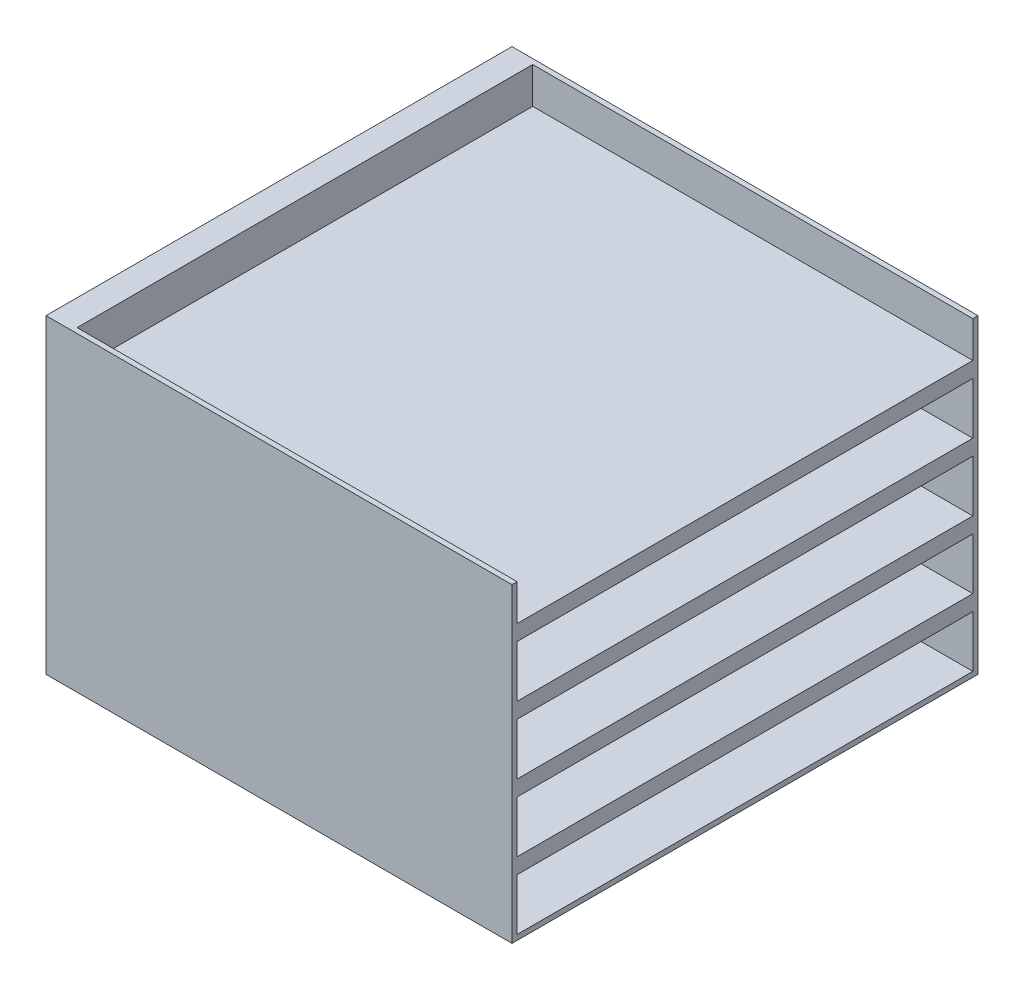
ISO-10303-21;
HEADER;
FILE_DESCRIPTION(('STEP AP214'),'2;1');
FILE_NAME('part.step','',(''),(''),'','','');
FILE_SCHEMA(('AUTOMOTIVE_DESIGN { 1 0 10303 214 1 1 1 1 }'));
ENDSEC;
DATA;
#1=APPLICATION_CONTEXT('core data for automotive mechanical design processes');
#2=APPLICATION_PROTOCOL_DEFINITION('international standard','automotive_design',2000,#1);
#3=PRODUCT_CONTEXT('',#1,'mechanical');
#4=PRODUCT('Part','Part','',(#3));
#5=PRODUCT_RELATED_PRODUCT_CATEGORY('part','',(#4));
#6=PRODUCT_DEFINITION_FORMATION('','',#4);
#7=PRODUCT_DEFINITION_CONTEXT('part definition',#1,'design');
#8=PRODUCT_DEFINITION('design','',#6,#7);
#9=PRODUCT_DEFINITION_SHAPE('','',#8);
#10=(LENGTH_UNIT() NAMED_UNIT(*) SI_UNIT(.MILLI.,.METRE.));
#11=(NAMED_UNIT(*) PLANE_ANGLE_UNIT() SI_UNIT($,.RADIAN.));
#12=(NAMED_UNIT(*) SI_UNIT($,.STERADIAN.) SOLID_ANGLE_UNIT());
#13=UNCERTAINTY_MEASURE_WITH_UNIT(LENGTH_MEASURE(1.E-05),#10,'distance_accuracy_value','');
#14=(GEOMETRIC_REPRESENTATION_CONTEXT(3) GLOBAL_UNCERTAINTY_ASSIGNED_CONTEXT((#13)) GLOBAL_UNIT_ASSIGNED_CONTEXT((#10,
#11,#12)) REPRESENTATION_CONTEXT('',''));
#15=CARTESIAN_POINT('',(0.,0.,0.));
#16=DIRECTION('',(0.,0.,1.));
#17=DIRECTION('',(1.,0.,0.));
#18=AXIS2_PLACEMENT_3D('',#15,#16,#17);
#19=CARTESIAN_POINT('',(450.,600.,-450.));
#20=DIRECTION('',(-1.,0.,0.));
#21=DIRECTION('',(0.,0.,1.));
#22=AXIS2_PLACEMENT_3D('',#19,#20,#21);
#23=PLANE('',#22);
#24=DIRECTION('',(0.,0.,-1.));
#25=VECTOR('',#24,1.);
#26=CARTESIAN_POINT('',(450.,140.,-440.));
#27=LINE('',#26,#25);
#28=CARTESIAN_POINT('',(450.,140.,440.));
#29=VERTEX_POINT('',#28);
#30=CARTESIAN_POINT('',(450.,140.,-440.));
#31=VERTEX_POINT('',#30);
#32=EDGE_CURVE('E223',#29,#31,#27,.T.);
#33=ORIENTED_EDGE('',*,*,#32,.F.);
#34=DIRECTION('',(0.,-1.,0.));
#35=VECTOR('',#34,1.);
#36=CARTESIAN_POINT('',(450.,240.,440.));
#37=LINE('',#36,#35);
#38=CARTESIAN_POINT('',(450.,240.,440.));
#39=VERTEX_POINT('',#38);
#40=EDGE_CURVE('E49',#39,#29,#37,.T.);
#41=ORIENTED_EDGE('',*,*,#40,.F.);
#42=DIRECTION('',(0.,0.,1.));
#43=VECTOR('',#42,1.);
#44=CARTESIAN_POINT('',(450.,240.,-440.));
#45=LINE('',#44,#43);
#46=CARTESIAN_POINT('',(450.,240.,-440.));
#47=VERTEX_POINT('',#46);
#48=EDGE_CURVE('E214',#47,#39,#45,.T.);
#49=ORIENTED_EDGE('',*,*,#48,.F.);
#50=DIRECTION('',(0.,1.,0.));
#51=VECTOR('',#50,1.);
#52=CARTESIAN_POINT('',(450.,240.,-440.));
#53=LINE('',#52,#51);
#54=EDGE_CURVE('E217',#31,#47,#53,.T.);
#55=ORIENTED_EDGE('',*,*,#54,.F.);
#56=EDGE_LOOP('',(#33,#41,#49,#55));
#57=FACE_BOUND('',#56,.T.);
#58=DIRECTION('',(0.,0.,-1.));
#59=VECTOR('',#58,1.);
#60=CARTESIAN_POINT('',(450.,270.,-439.999999999999));
#61=LINE('',#60,#59);
#62=CARTESIAN_POINT('',(450.,270.,440.000000000001));
#63=VERTEX_POINT('',#62);
#64=CARTESIAN_POINT('',(450.,270.,-439.999999999999));
#65=VERTEX_POINT('',#64);
#66=EDGE_CURVE('E249',#63,#65,#61,.T.);
#67=ORIENTED_EDGE('',*,*,#66,.F.);
#68=DIRECTION('',(0.,-1.,0.));
#69=VECTOR('',#68,1.);
#70=CARTESIAN_POINT('',(450.,370.,440.000000000001));
#71=LINE('',#70,#69);
#72=CARTESIAN_POINT('',(450.,370.,440.000000000001));
#73=VERTEX_POINT('',#72);
#74=EDGE_CURVE('E57',#73,#63,#71,.T.);
#75=ORIENTED_EDGE('',*,*,#74,.F.);
#76=DIRECTION('',(0.,0.,1.));
#77=VECTOR('',#76,1.);
#78=CARTESIAN_POINT('',(450.,370.,-439.999999999999));
#79=LINE('',#78,#77);
#80=CARTESIAN_POINT('',(450.,370.,-439.999999999999));
#81=VERTEX_POINT('',#80);
#82=EDGE_CURVE('E238',#81,#73,#79,.T.);
#83=ORIENTED_EDGE('',*,*,#82,.F.);
#84=DIRECTION('',(0.,1.,0.));
#85=VECTOR('',#84,1.);
#86=CARTESIAN_POINT('',(450.,370.,-439.999999999999));
#87=LINE('',#86,#85);
#88=EDGE_CURVE('E253',#65,#81,#87,.T.);
#89=ORIENTED_EDGE('',*,*,#88,.F.);
#90=EDGE_LOOP('',(#67,#75,#83,#89));
#91=FACE_BOUND('',#90,.T.);
#92=DIRECTION('',(0.,0.,-1.));
#93=VECTOR('',#92,1.);
#94=CARTESIAN_POINT('',(450.,400.,-439.999999999999));
#95=LINE('',#94,#93);
#96=CARTESIAN_POINT('',(450.,400.,440.000000000001));
#97=VERTEX_POINT('',#96);
#98=CARTESIAN_POINT('',(450.,400.,-439.999999999999));
#99=VERTEX_POINT('',#98);
#100=EDGE_CURVE('E280',#97,#99,#95,.T.);
#101=ORIENTED_EDGE('',*,*,#100,.F.);
#102=DIRECTION('',(0.,-1.,0.));
#103=VECTOR('',#102,1.);
#104=CARTESIAN_POINT('',(450.,500.,440.000000000001));
#105=LINE('',#104,#103);
#106=CARTESIAN_POINT('',(450.,500.,440.000000000001));
#107=VERTEX_POINT('',#106);
#108=EDGE_CURVE('E278',#107,#97,#105,.T.);
#109=ORIENTED_EDGE('',*,*,#108,.F.);
#110=DIRECTION('',(0.,0.,1.));
#111=VECTOR('',#110,1.);
#112=CARTESIAN_POINT('',(450.,500.,-439.999999999999));
#113=LINE('',#112,#111);
#114=CARTESIAN_POINT('',(450.,500.,-439.999999999999));
#115=VERTEX_POINT('',#114);
#116=EDGE_CURVE('E268',#115,#107,#113,.T.);
#117=ORIENTED_EDGE('',*,*,#116,.F.);
#118=DIRECTION('',(0.,1.,0.));
#119=VECTOR('',#118,1.);
#120=CARTESIAN_POINT('',(450.,500.,-439.999999999999));
#121=LINE('',#120,#119);
#122=EDGE_CURVE('E284',#99,#115,#121,.T.);
#123=ORIENTED_EDGE('',*,*,#122,.F.);
#124=EDGE_LOOP('',(#101,#109,#117,#123));
#125=FACE_BOUND('',#124,.T.);
#126=DIRECTION('',(0.,0.,-1.));
#127=VECTOR('',#126,1.);
#128=CARTESIAN_POINT('',(450.,10.,-440.));
#129=LINE('',#128,#127);
#130=CARTESIAN_POINT('',(450.,10.,440.));
#131=VERTEX_POINT('',#130);
#132=CARTESIAN_POINT('',(450.,10.,-440.));
#133=VERTEX_POINT('',#132);
#134=EDGE_CURVE('E329',#131,#133,#129,.T.);
#135=ORIENTED_EDGE('',*,*,#134,.F.);
#136=DIRECTION('',(0.,-1.,0.));
#137=VECTOR('',#136,1.);
#138=CARTESIAN_POINT('',(450.,110.,440.));
#139=LINE('',#138,#137);
#140=CARTESIAN_POINT('',(450.,110.,440.));
#141=VERTEX_POINT('',#140);
#142=EDGE_CURVE('E230',#141,#131,#139,.T.);
#143=ORIENTED_EDGE('',*,*,#142,.F.);
#144=DIRECTION('',(0.,0.,1.));
#145=VECTOR('',#144,1.);
#146=CARTESIAN_POINT('',(450.,110.,-440.));
#147=LINE('',#146,#145);
#148=CARTESIAN_POINT('',(450.,110.,-440.));
#149=VERTEX_POINT('',#148);
#150=EDGE_CURVE('E318',#149,#141,#147,.T.);
#151=ORIENTED_EDGE('',*,*,#150,.F.);
#152=DIRECTION('',(0.,1.,0.));
#153=VECTOR('',#152,1.);
#154=CARTESIAN_POINT('',(450.,110.,-440.));
#155=LINE('',#154,#153);
#156=EDGE_CURVE('E332',#133,#149,#155,.T.);
#157=ORIENTED_EDGE('',*,*,#156,.F.);
#158=EDGE_LOOP('',(#135,#143,#151,#157));
#159=FACE_BOUND('',#158,.T.);
#160=DIRECTION('',(0.,0.,-1.));
#161=VECTOR('',#160,1.);
#162=CARTESIAN_POINT('',(450.,530.,-439.999999999998));
#163=LINE('',#162,#161);
#164=CARTESIAN_POINT('',(450.,530.,440.000000000002));
#165=VERTEX_POINT('',#164);
#166=CARTESIAN_POINT('',(450.,530.,-439.999999999998));
#167=VERTEX_POINT('',#166);
#168=EDGE_CURVE('E307',#165,#167,#163,.T.);
#169=ORIENTED_EDGE('',*,*,#168,.F.);
#170=DIRECTION('',(0.,-1.,0.));
#171=VECTOR('',#170,1.);
#172=CARTESIAN_POINT('',(450.,630.,440.000000000002));
#173=LINE('',#172,#171);
#174=CARTESIAN_POINT('',(450.,600.,440.000000000002));
#175=VERTEX_POINT('',#174);
#176=EDGE_CURVE('E305',#175,#165,#173,.T.);
#177=ORIENTED_EDGE('',*,*,#176,.F.);
#178=DIRECTION('',(0.,0.,-1.));
#179=VECTOR('',#178,1.);
#180=CARTESIAN_POINT('',(450.,600.,-450.));
#181=LINE('',#180,#179);
#182=CARTESIAN_POINT('',(450.,600.,450.));
#183=VERTEX_POINT('',#182);
#184=EDGE_CURVE('E346',#183,#175,#181,.T.);
#185=ORIENTED_EDGE('',*,*,#184,.F.);
#186=DIRECTION('',(0.,-1.,0.));
#187=VECTOR('',#186,1.);
#188=CARTESIAN_POINT('',(450.,600.,450.));
#189=LINE('',#188,#187);
#190=CARTESIAN_POINT('',(450.,0.,450.));
#191=VERTEX_POINT('',#190);
#192=EDGE_CURVE('E356',#183,#191,#189,.T.);
#193=ORIENTED_EDGE('',*,*,#192,.T.);
#194=DIRECTION('',(0.,0.,-1.));
#195=VECTOR('',#194,1.);
#196=CARTESIAN_POINT('',(450.,0.,-450.));
#197=LINE('',#196,#195);
#198=CARTESIAN_POINT('',(450.,0.,-450.));
#199=VERTEX_POINT('',#198);
#200=EDGE_CURVE('E339',#191,#199,#197,.T.);
#201=ORIENTED_EDGE('',*,*,#200,.T.);
#202=DIRECTION('',(0.,-1.,0.));
#203=VECTOR('',#202,1.);
#204=CARTESIAN_POINT('',(450.,600.,-450.));
#205=LINE('',#204,#203);
#206=CARTESIAN_POINT('',(450.,600.,-450.));
#207=VERTEX_POINT('',#206);
#208=EDGE_CURVE('E373',#207,#199,#205,.T.);
#209=ORIENTED_EDGE('',*,*,#208,.F.);
#210=CARTESIAN_POINT('',(450.,600.,-439.999999999998));
#211=VERTEX_POINT('',#210);
#212=EDGE_CURVE('E350',#211,#207,#181,.T.);
#213=ORIENTED_EDGE('',*,*,#212,.F.);
#214=DIRECTION('',(0.,1.,0.));
#215=VECTOR('',#214,1.);
#216=CARTESIAN_POINT('',(450.,630.,-439.999999999998));
#217=LINE('',#216,#215);
#218=EDGE_CURVE('E299',#167,#211,#217,.T.);
#219=ORIENTED_EDGE('',*,*,#218,.F.);
#220=EDGE_LOOP('',(#169,#177,#185,#193,#201,#209,#213,#219));
#221=FACE_BOUND('',#220,.T.);
#222=ADVANCED_FACE('F35',(#57,#91,#125,#159,#221),#23,.F.);
#223=CARTESIAN_POINT('',(-450.,600.,-450.));
#224=DIRECTION('',(0.,0.,1.));
#225=DIRECTION('',(1.,0.,0.));
#226=AXIS2_PLACEMENT_3D('',#223,#224,#225);
#227=PLANE('',#226);
#228=DIRECTION('',(-1.,0.,0.));
#229=VECTOR('',#228,1.);
#230=CARTESIAN_POINT('',(-450.,0.,-450.));
#231=LINE('',#230,#229);
#232=CARTESIAN_POINT('',(-450.,0.,-450.));
#233=VERTEX_POINT('',#232);
#234=EDGE_CURVE('E359',#199,#233,#231,.T.);
#235=ORIENTED_EDGE('',*,*,#234,.T.);
#236=DIRECTION('',(0.,-1.,0.));
#237=VECTOR('',#236,1.);
#238=CARTESIAN_POINT('',(-450.,600.,-450.));
#239=LINE('',#238,#237);
#240=CARTESIAN_POINT('',(-450.,600.,-450.));
#241=VERTEX_POINT('',#240);
#242=EDGE_CURVE('E370',#241,#233,#239,.T.);
#243=ORIENTED_EDGE('',*,*,#242,.F.);
#244=DIRECTION('',(-1.,0.,0.));
#245=VECTOR('',#244,1.);
#246=CARTESIAN_POINT('',(-450.,600.,-450.));
#247=LINE('',#246,#245);
#248=EDGE_CURVE('E349',#207,#241,#247,.T.);
#249=ORIENTED_EDGE('',*,*,#248,.F.);
#250=ORIENTED_EDGE('',*,*,#208,.T.);
#251=EDGE_LOOP('',(#235,#243,#249,#250));
#252=FACE_BOUND('',#251,.T.);
#253=ADVANCED_FACE('F404',(#252),#227,.F.);
#254=CARTESIAN_POINT('',(-450.,600.,-450.));
#255=DIRECTION('',(1.,0.,0.));
#256=DIRECTION('',(0.,0.,-1.));
#257=AXIS2_PLACEMENT_3D('',#254,#255,#256);
#258=PLANE('',#257);
#259=DIRECTION('',(0.,0.,1.));
#260=VECTOR('',#259,1.);
#261=CARTESIAN_POINT('',(-450.,0.,-450.));
#262=LINE('',#261,#260);
#263=CARTESIAN_POINT('',(-450.,0.,450.));
#264=VERTEX_POINT('',#263);
#265=EDGE_CURVE('E361',#233,#264,#262,.T.);
#266=ORIENTED_EDGE('',*,*,#265,.T.);
#267=DIRECTION('',(0.,-1.,0.));
#268=VECTOR('',#267,1.);
#269=CARTESIAN_POINT('',(-450.,600.,450.));
#270=LINE('',#269,#268);
#271=CARTESIAN_POINT('',(-450.,600.,450.));
#272=VERTEX_POINT('',#271);
#273=EDGE_CURVE('E367',#272,#264,#270,.T.);
#274=ORIENTED_EDGE('',*,*,#273,.F.);
#275=DIRECTION('',(0.,0.,1.));
#276=VECTOR('',#275,1.);
#277=CARTESIAN_POINT('',(-450.,600.,-450.));
#278=LINE('',#277,#276);
#279=EDGE_CURVE('E352',#241,#272,#278,.T.);
#280=ORIENTED_EDGE('',*,*,#279,.F.);
#281=ORIENTED_EDGE('',*,*,#242,.T.);
#282=EDGE_LOOP('',(#266,#274,#280,#281));
#283=FACE_BOUND('',#282,.T.);
#284=ADVANCED_FACE('F409',(#283),#258,.F.);
#285=CARTESIAN_POINT('',(-450.,600.,450.));
#286=DIRECTION('',(0.,0.,-1.));
#287=DIRECTION('',(-1.,0.,0.));
#288=AXIS2_PLACEMENT_3D('',#285,#286,#287);
#289=PLANE('',#288);
#290=DIRECTION('',(1.,0.,0.));
#291=VECTOR('',#290,1.);
#292=CARTESIAN_POINT('',(-450.,0.,450.));
#293=LINE('',#292,#291);
#294=EDGE_CURVE('E363',#264,#191,#293,.T.);
#295=ORIENTED_EDGE('',*,*,#294,.T.);
#296=ORIENTED_EDGE('',*,*,#192,.F.);
#297=DIRECTION('',(1.,0.,0.));
#298=VECTOR('',#297,1.);
#299=CARTESIAN_POINT('',(-450.,600.,450.));
#300=LINE('',#299,#298);
#301=EDGE_CURVE('E354',#272,#183,#300,.T.);
#302=ORIENTED_EDGE('',*,*,#301,.F.);
#303=ORIENTED_EDGE('',*,*,#273,.T.);
#304=EDGE_LOOP('',(#295,#296,#302,#303));
#305=FACE_BOUND('',#304,.T.);
#306=ADVANCED_FACE('F414',(#305),#289,.F.);
#307=CARTESIAN_POINT('',(0.,600.,0.));
#308=DIRECTION('',(0.,1.,0.));
#309=DIRECTION('',(0.,0.,1.));
#310=AXIS2_PLACEMENT_3D('',#307,#308,#309);
#311=PLANE('',#310);
#312=DIRECTION('',(1.,0.,0.));
#313=VECTOR('',#312,1.);
#314=CARTESIAN_POINT('',(0.,600.,440.000000000002));
#315=LINE('',#314,#313);
#316=CARTESIAN_POINT('',(-400.,600.,440.000000000002));
#317=VERTEX_POINT('',#316);
#318=EDGE_CURVE('E11',#317,#175,#315,.T.);
#319=ORIENTED_EDGE('',*,*,#318,.F.);
#320=DIRECTION('',(0.,0.,1.));
#321=VECTOR('',#320,1.);
#322=CARTESIAN_POINT('',(-400.,600.,0.));
#323=LINE('',#322,#321);
#324=CARTESIAN_POINT('',(-400.,600.,-439.999999999998));
#325=VERTEX_POINT('',#324);
#326=EDGE_CURVE('E376',#325,#317,#323,.T.);
#327=ORIENTED_EDGE('',*,*,#326,.F.);
#328=DIRECTION('',(-1.,0.,0.));
#329=VECTOR('',#328,1.);
#330=CARTESIAN_POINT('',(0.,600.,-439.999999999998));
#331=LINE('',#330,#329);
#332=EDGE_CURVE('E42',#211,#325,#331,.T.);
#333=ORIENTED_EDGE('',*,*,#332,.F.);
#334=ORIENTED_EDGE('',*,*,#212,.T.);
#335=ORIENTED_EDGE('',*,*,#248,.T.);
#336=ORIENTED_EDGE('',*,*,#279,.T.);
#337=ORIENTED_EDGE('',*,*,#301,.T.);
#338=ORIENTED_EDGE('',*,*,#184,.T.);
#339=EDGE_LOOP('',(#319,#327,#333,#334,#335,#336,#337,#338));
#340=FACE_BOUND('',#339,.T.);
#341=ADVANCED_FACE('F387',(#340),#311,.T.);
#342=CARTESIAN_POINT('',(0.,0.,0.));
#343=DIRECTION('',(0.,1.,0.));
#344=DIRECTION('',(0.,0.,1.));
#345=AXIS2_PLACEMENT_3D('',#342,#343,#344);
#346=PLANE('',#345);
#347=ORIENTED_EDGE('',*,*,#200,.F.);
#348=ORIENTED_EDGE('',*,*,#294,.F.);
#349=ORIENTED_EDGE('',*,*,#265,.F.);
#350=ORIENTED_EDGE('',*,*,#234,.F.);
#351=EDGE_LOOP('',(#347,#348,#349,#350));
#352=FACE_BOUND('',#351,.T.);
#353=ADVANCED_FACE('F418',(#352),#346,.F.);
#354=CARTESIAN_POINT('',(-400.,110.,440.));
#355=DIRECTION('',(0.,0.,1.));
#356=DIRECTION('',(1.,0.,0.));
#357=AXIS2_PLACEMENT_3D('',#354,#355,#356);
#358=PLANE('',#357);
#359=ORIENTED_EDGE('',*,*,#142,.T.);
#360=DIRECTION('',(1.,0.,0.));
#361=VECTOR('',#360,1.);
#362=CARTESIAN_POINT('',(-400.,10.,440.));
#363=LINE('',#362,#361);
#364=CARTESIAN_POINT('',(-400.,10.,440.));
#365=VERTEX_POINT('',#364);
#366=EDGE_CURVE('E327',#365,#131,#363,.T.);
#367=ORIENTED_EDGE('',*,*,#366,.F.);
#368=DIRECTION('',(0.,-1.,0.));
#369=VECTOR('',#368,1.);
#370=CARTESIAN_POINT('',(-400.,110.,440.));
#371=LINE('',#370,#369);
#372=CARTESIAN_POINT('',(-400.,110.,440.));
#373=VERTEX_POINT('',#372);
#374=EDGE_CURVE('E314',#373,#365,#371,.T.);
#375=ORIENTED_EDGE('',*,*,#374,.F.);
#376=DIRECTION('',(1.,0.,0.));
#377=VECTOR('',#376,1.);
#378=CARTESIAN_POINT('',(-400.,110.,440.));
#379=LINE('',#378,#377);
#380=EDGE_CURVE('E337',#373,#141,#379,.T.);
#381=ORIENTED_EDGE('',*,*,#380,.T.);
#382=EDGE_LOOP('',(#359,#367,#375,#381));
#383=FACE_BOUND('',#382,.T.);
#384=ADVANCED_FACE('F420',(#383),#358,.F.);
#385=CARTESIAN_POINT('',(-400.,110.,-440.));
#386=DIRECTION('',(0.,1.,0.));
#387=DIRECTION('',(0.,0.,1.));
#388=AXIS2_PLACEMENT_3D('',#385,#386,#387);
#389=PLANE('',#388);
#390=ORIENTED_EDGE('',*,*,#150,.T.);
#391=ORIENTED_EDGE('',*,*,#380,.F.);
#392=DIRECTION('',(0.,0.,1.));
#393=VECTOR('',#392,1.);
#394=CARTESIAN_POINT('',(-400.,110.,-440.));
#395=LINE('',#394,#393);
#396=CARTESIAN_POINT('',(-400.,110.,-440.));
#397=VERTEX_POINT('',#396);
#398=EDGE_CURVE('E324',#397,#373,#395,.T.);
#399=ORIENTED_EDGE('',*,*,#398,.F.);
#400=DIRECTION('',(1.,0.,0.));
#401=VECTOR('',#400,1.);
#402=CARTESIAN_POINT('',(-400.,110.,-440.));
#403=LINE('',#402,#401);
#404=EDGE_CURVE('E340',#397,#149,#403,.T.);
#405=ORIENTED_EDGE('',*,*,#404,.T.);
#406=EDGE_LOOP('',(#390,#391,#399,#405));
#407=FACE_BOUND('',#406,.T.);
#408=ADVANCED_FACE('F426',(#407),#389,.F.);
#409=CARTESIAN_POINT('',(-400.,110.,-440.));
#410=DIRECTION('',(0.,0.,-1.));
#411=DIRECTION('',(-1.,0.,0.));
#412=AXIS2_PLACEMENT_3D('',#409,#410,#411);
#413=PLANE('',#412);
#414=ORIENTED_EDGE('',*,*,#156,.T.);
#415=ORIENTED_EDGE('',*,*,#404,.F.);
#416=DIRECTION('',(0.,1.,0.));
#417=VECTOR('',#416,1.);
#418=CARTESIAN_POINT('',(-400.,110.,-440.));
#419=LINE('',#418,#417);
#420=CARTESIAN_POINT('',(-400.,10.,-440.));
#421=VERTEX_POINT('',#420);
#422=EDGE_CURVE('E321',#421,#397,#419,.T.);
#423=ORIENTED_EDGE('',*,*,#422,.F.);
#424=DIRECTION('',(1.,0.,0.));
#425=VECTOR('',#424,1.);
#426=CARTESIAN_POINT('',(-400.,10.,-440.));
#427=LINE('',#426,#425);
#428=EDGE_CURVE('E342',#421,#133,#427,.T.);
#429=ORIENTED_EDGE('',*,*,#428,.T.);
#430=EDGE_LOOP('',(#414,#415,#423,#429));
#431=FACE_BOUND('',#430,.T.);
#432=ADVANCED_FACE('F457',(#431),#413,.F.);
#433=CARTESIAN_POINT('',(-400.,10.,-440.));
#434=DIRECTION('',(0.,-1.,0.));
#435=DIRECTION('',(0.,0.,-1.));
#436=AXIS2_PLACEMENT_3D('',#433,#434,#435);
#437=PLANE('',#436);
#438=ORIENTED_EDGE('',*,*,#134,.T.);
#439=ORIENTED_EDGE('',*,*,#428,.F.);
#440=DIRECTION('',(0.,0.,-1.));
#441=VECTOR('',#440,1.);
#442=CARTESIAN_POINT('',(-400.,10.,-440.));
#443=LINE('',#442,#441);
#444=EDGE_CURVE('E317',#365,#421,#443,.T.);
#445=ORIENTED_EDGE('',*,*,#444,.F.);
#446=ORIENTED_EDGE('',*,*,#366,.T.);
#447=EDGE_LOOP('',(#438,#439,#445,#446));
#448=FACE_BOUND('',#447,.T.);
#449=ADVANCED_FACE('F450',(#448),#437,.F.);
#450=CARTESIAN_POINT('',(-400.,0.,1.04854396770154E-13));
#451=DIRECTION('',(-1.,0.,0.));
#452=DIRECTION('',(0.,0.,1.));
#453=AXIS2_PLACEMENT_3D('',#450,#451,#452);
#454=PLANE('',#453);
#455=ORIENTED_EDGE('',*,*,#374,.T.);
#456=ORIENTED_EDGE('',*,*,#444,.T.);
#457=ORIENTED_EDGE('',*,*,#422,.T.);
#458=ORIENTED_EDGE('',*,*,#398,.T.);
#459=EDGE_LOOP('',(#455,#456,#457,#458));
#460=FACE_BOUND('',#459,.T.);
#461=ADVANCED_FACE('F459',(#460),#454,.F.);
#462=CARTESIAN_POINT('',(-400.,630.,440.000000000002));
#463=DIRECTION('',(0.,0.,1.));
#464=DIRECTION('',(1.,0.,0.));
#465=AXIS2_PLACEMENT_3D('',#462,#463,#464);
#466=PLANE('',#465);
#467=ORIENTED_EDGE('',*,*,#318,.T.);
#468=ORIENTED_EDGE('',*,*,#176,.T.);
#469=DIRECTION('',(1.,0.,0.));
#470=VECTOR('',#469,1.);
#471=CARTESIAN_POINT('',(-400.,530.,440.000000000002));
#472=LINE('',#471,#470);
#473=CARTESIAN_POINT('',(-400.,530.,440.000000000002));
#474=VERTEX_POINT('',#473);
#475=EDGE_CURVE('E304',#474,#165,#472,.T.);
#476=ORIENTED_EDGE('',*,*,#475,.F.);
#477=DIRECTION('',(0.,-1.,0.));
#478=VECTOR('',#477,1.);
#479=CARTESIAN_POINT('',(-400.,630.,440.000000000002));
#480=LINE('',#479,#478);
#481=EDGE_CURVE('E296',#317,#474,#480,.T.);
#482=ORIENTED_EDGE('',*,*,#481,.F.);
#483=EDGE_LOOP('',(#467,#468,#476,#482));
#484=FACE_BOUND('',#483,.T.);
#485=ADVANCED_FACE('F393',(#484),#466,.F.);
#486=CARTESIAN_POINT('',(-400.,630.,-439.999999999998));
#487=DIRECTION('',(0.,0.,-1.));
#488=DIRECTION('',(-1.,0.,0.));
#489=AXIS2_PLACEMENT_3D('',#486,#487,#488);
#490=PLANE('',#489);
#491=ORIENTED_EDGE('',*,*,#332,.T.);
#492=DIRECTION('',(0.,1.,0.));
#493=VECTOR('',#492,1.);
#494=CARTESIAN_POINT('',(-400.,630.,-439.999999999998));
#495=LINE('',#494,#493);
#496=CARTESIAN_POINT('',(-400.,530.,-439.999999999998));
#497=VERTEX_POINT('',#496);
#498=EDGE_CURVE('E302',#497,#325,#495,.T.);
#499=ORIENTED_EDGE('',*,*,#498,.F.);
#500=DIRECTION('',(1.,0.,0.));
#501=VECTOR('',#500,1.);
#502=CARTESIAN_POINT('',(-400.,530.,-439.999999999998));
#503=LINE('',#502,#501);
#504=EDGE_CURVE('E281',#497,#167,#503,.T.);
#505=ORIENTED_EDGE('',*,*,#504,.T.);
#506=ORIENTED_EDGE('',*,*,#218,.T.);
#507=EDGE_LOOP('',(#491,#499,#505,#506));
#508=FACE_BOUND('',#507,.T.);
#509=ADVANCED_FACE('F382',(#508),#490,.F.);
#510=CARTESIAN_POINT('',(-400.,530.,-439.999999999998));
#511=DIRECTION('',(0.,-1.,0.));
#512=DIRECTION('',(0.,0.,-1.));
#513=AXIS2_PLACEMENT_3D('',#510,#511,#512);
#514=PLANE('',#513);
#515=ORIENTED_EDGE('',*,*,#168,.T.);
#516=ORIENTED_EDGE('',*,*,#504,.F.);
#517=DIRECTION('',(0.,0.,-1.));
#518=VECTOR('',#517,1.);
#519=CARTESIAN_POINT('',(-400.,530.,-439.999999999998));
#520=LINE('',#519,#518);
#521=EDGE_CURVE('E298',#474,#497,#520,.T.);
#522=ORIENTED_EDGE('',*,*,#521,.F.);
#523=ORIENTED_EDGE('',*,*,#475,.T.);
#524=EDGE_LOOP('',(#515,#516,#522,#523));
#525=FACE_BOUND('',#524,.T.);
#526=ADVANCED_FACE('F398',(#525),#514,.F.);
#527=CARTESIAN_POINT('',(-400.,0.,1.04854396770154E-13));
#528=DIRECTION('',(-1.,0.,0.));
#529=DIRECTION('',(0.,0.,1.));
#530=AXIS2_PLACEMENT_3D('',#527,#528,#529);
#531=PLANE('',#530);
#532=ORIENTED_EDGE('',*,*,#326,.T.);
#533=ORIENTED_EDGE('',*,*,#481,.T.);
#534=ORIENTED_EDGE('',*,*,#521,.T.);
#535=ORIENTED_EDGE('',*,*,#498,.T.);
#536=EDGE_LOOP('',(#532,#533,#534,#535));
#537=FACE_BOUND('',#536,.T.);
#538=ADVANCED_FACE('F390',(#537),#531,.F.);
#539=CARTESIAN_POINT('',(-400.,500.,440.000000000001));
#540=DIRECTION('',(0.,0.,1.));
#541=DIRECTION('',(1.,0.,0.));
#542=AXIS2_PLACEMENT_3D('',#539,#540,#541);
#543=PLANE('',#542);
#544=ORIENTED_EDGE('',*,*,#108,.T.);
#545=DIRECTION('',(1.,0.,0.));
#546=VECTOR('',#545,1.);
#547=CARTESIAN_POINT('',(-400.,400.,440.000000000001));
#548=LINE('',#547,#546);
#549=CARTESIAN_POINT('',(-400.,400.,440.000000000001));
#550=VERTEX_POINT('',#549);
#551=EDGE_CURVE('E277',#550,#97,#548,.T.);
#552=ORIENTED_EDGE('',*,*,#551,.F.);
#553=DIRECTION('',(0.,-1.,0.));
#554=VECTOR('',#553,1.);
#555=CARTESIAN_POINT('',(-400.,500.,440.000000000001));
#556=LINE('',#555,#554);
#557=CARTESIAN_POINT('',(-400.,500.,440.000000000001));
#558=VERTEX_POINT('',#557);
#559=EDGE_CURVE('E264',#558,#550,#556,.T.);
#560=ORIENTED_EDGE('',*,*,#559,.F.);
#561=DIRECTION('',(1.,0.,0.));
#562=VECTOR('',#561,1.);
#563=CARTESIAN_POINT('',(-400.,500.,440.000000000001));
#564=LINE('',#563,#562);
#565=EDGE_CURVE('E250',#558,#107,#564,.T.);
#566=ORIENTED_EDGE('',*,*,#565,.T.);
#567=EDGE_LOOP('',(#544,#552,#560,#566));
#568=FACE_BOUND('',#567,.T.);
#569=ADVANCED_FACE('F515',(#568),#543,.F.);
#570=CARTESIAN_POINT('',(-400.,500.,-439.999999999999));
#571=DIRECTION('',(0.,1.,0.));
#572=DIRECTION('',(0.,0.,1.));
#573=AXIS2_PLACEMENT_3D('',#570,#571,#572);
#574=PLANE('',#573);
#575=ORIENTED_EDGE('',*,*,#116,.T.);
#576=ORIENTED_EDGE('',*,*,#565,.F.);
#577=DIRECTION('',(0.,0.,1.));
#578=VECTOR('',#577,1.);
#579=CARTESIAN_POINT('',(-400.,500.,-439.999999999999));
#580=LINE('',#579,#578);
#581=CARTESIAN_POINT('',(-400.,500.,-439.999999999999));
#582=VERTEX_POINT('',#581);
#583=EDGE_CURVE('E274',#582,#558,#580,.T.);
#584=ORIENTED_EDGE('',*,*,#583,.F.);
#585=DIRECTION('',(1.,0.,0.));
#586=VECTOR('',#585,1.);
#587=CARTESIAN_POINT('',(-400.,500.,-439.999999999999));
#588=LINE('',#587,#586);
#589=EDGE_CURVE('E290',#582,#115,#588,.T.);
#590=ORIENTED_EDGE('',*,*,#589,.T.);
#591=EDGE_LOOP('',(#575,#576,#584,#590));
#592=FACE_BOUND('',#591,.T.);
#593=ADVANCED_FACE('F524',(#592),#574,.F.);
#594=CARTESIAN_POINT('',(-400.,500.,-439.999999999999));
#595=DIRECTION('',(0.,0.,-1.));
#596=DIRECTION('',(-1.,0.,0.));
#597=AXIS2_PLACEMENT_3D('',#594,#595,#596);
#598=PLANE('',#597);
#599=ORIENTED_EDGE('',*,*,#122,.T.);
#600=ORIENTED_EDGE('',*,*,#589,.F.);
#601=DIRECTION('',(0.,1.,0.));
#602=VECTOR('',#601,1.);
#603=CARTESIAN_POINT('',(-400.,500.,-439.999999999999));
#604=LINE('',#603,#602);
#605=CARTESIAN_POINT('',(-400.,400.,-439.999999999999));
#606=VERTEX_POINT('',#605);
#607=EDGE_CURVE('E271',#606,#582,#604,.T.);
#608=ORIENTED_EDGE('',*,*,#607,.F.);
#609=DIRECTION('',(1.,0.,0.));
#610=VECTOR('',#609,1.);
#611=CARTESIAN_POINT('',(-400.,400.,-439.999999999999));
#612=LINE('',#611,#610);
#613=EDGE_CURVE('E292',#606,#99,#612,.T.);
#614=ORIENTED_EDGE('',*,*,#613,.T.);
#615=EDGE_LOOP('',(#599,#600,#608,#614));
#616=FACE_BOUND('',#615,.T.);
#617=ADVANCED_FACE('F534',(#616),#598,.F.);
#618=CARTESIAN_POINT('',(-400.,400.,-439.999999999999));
#619=DIRECTION('',(0.,-1.,0.));
#620=DIRECTION('',(0.,0.,-1.));
#621=AXIS2_PLACEMENT_3D('',#618,#619,#620);
#622=PLANE('',#621);
#623=ORIENTED_EDGE('',*,*,#100,.T.);
#624=ORIENTED_EDGE('',*,*,#613,.F.);
#625=DIRECTION('',(0.,0.,-1.));
#626=VECTOR('',#625,1.);
#627=CARTESIAN_POINT('',(-400.,400.,-439.999999999999));
#628=LINE('',#627,#626);
#629=EDGE_CURVE('E267',#550,#606,#628,.T.);
#630=ORIENTED_EDGE('',*,*,#629,.F.);
#631=ORIENTED_EDGE('',*,*,#551,.T.);
#632=EDGE_LOOP('',(#623,#624,#630,#631));
#633=FACE_BOUND('',#632,.T.);
#634=ADVANCED_FACE('F544',(#633),#622,.F.);
#635=CARTESIAN_POINT('',(-400.,0.,1.04854396770154E-13));
#636=DIRECTION('',(-1.,0.,0.));
#637=DIRECTION('',(0.,0.,1.));
#638=AXIS2_PLACEMENT_3D('',#635,#636,#637);
#639=PLANE('',#638);
#640=ORIENTED_EDGE('',*,*,#559,.T.);
#641=ORIENTED_EDGE('',*,*,#629,.T.);
#642=ORIENTED_EDGE('',*,*,#607,.T.);
#643=ORIENTED_EDGE('',*,*,#583,.T.);
#644=EDGE_LOOP('',(#640,#641,#642,#643));
#645=FACE_BOUND('',#644,.T.);
#646=ADVANCED_FACE('F554',(#645),#639,.F.);
#647=CARTESIAN_POINT('',(-400.,370.,440.000000000001));
#648=DIRECTION('',(0.,0.,1.));
#649=DIRECTION('',(1.,0.,0.));
#650=AXIS2_PLACEMENT_3D('',#647,#648,#649);
#651=PLANE('',#650);
#652=ORIENTED_EDGE('',*,*,#74,.T.);
#653=DIRECTION('',(1.,0.,0.));
#654=VECTOR('',#653,1.);
#655=CARTESIAN_POINT('',(-400.,270.,440.000000000001));
#656=LINE('',#655,#654);
#657=CARTESIAN_POINT('',(-400.,270.,440.000000000001));
#658=VERTEX_POINT('',#657);
#659=EDGE_CURVE('E247',#658,#63,#656,.T.);
#660=ORIENTED_EDGE('',*,*,#659,.F.);
#661=DIRECTION('',(0.,-1.,0.));
#662=VECTOR('',#661,1.);
#663=CARTESIAN_POINT('',(-400.,370.,440.000000000001));
#664=LINE('',#663,#662);
#665=CARTESIAN_POINT('',(-400.,370.,440.000000000001));
#666=VERTEX_POINT('',#665);
#667=EDGE_CURVE('E234',#666,#658,#664,.T.);
#668=ORIENTED_EDGE('',*,*,#667,.F.);
#669=DIRECTION('',(1.,0.,0.));
#670=VECTOR('',#669,1.);
#671=CARTESIAN_POINT('',(-400.,370.,440.000000000001));
#672=LINE('',#671,#670);
#673=EDGE_CURVE('E224',#666,#73,#672,.T.);
#674=ORIENTED_EDGE('',*,*,#673,.T.);
#675=EDGE_LOOP('',(#652,#660,#668,#674));
#676=FACE_BOUND('',#675,.T.);
#677=ADVANCED_FACE('F564',(#676),#651,.F.);
#678=CARTESIAN_POINT('',(-400.,370.,-439.999999999999));
#679=DIRECTION('',(0.,1.,0.));
#680=DIRECTION('',(0.,0.,1.));
#681=AXIS2_PLACEMENT_3D('',#678,#679,#680);
#682=PLANE('',#681);
#683=ORIENTED_EDGE('',*,*,#82,.T.);
#684=ORIENTED_EDGE('',*,*,#673,.F.);
#685=DIRECTION('',(0.,0.,1.));
#686=VECTOR('',#685,1.);
#687=CARTESIAN_POINT('',(-400.,370.,-439.999999999999));
#688=LINE('',#687,#686);
#689=CARTESIAN_POINT('',(-400.,370.,-439.999999999999));
#690=VERTEX_POINT('',#689);
#691=EDGE_CURVE('E244',#690,#666,#688,.T.);
#692=ORIENTED_EDGE('',*,*,#691,.F.);
#693=DIRECTION('',(1.,0.,0.));
#694=VECTOR('',#693,1.);
#695=CARTESIAN_POINT('',(-400.,370.,-439.999999999999));
#696=LINE('',#695,#694);
#697=EDGE_CURVE('E259',#690,#81,#696,.T.);
#698=ORIENTED_EDGE('',*,*,#697,.T.);
#699=EDGE_LOOP('',(#683,#684,#692,#698));
#700=FACE_BOUND('',#699,.T.);
#701=ADVANCED_FACE('F574',(#700),#682,.F.);
#702=CARTESIAN_POINT('',(-400.,370.,-439.999999999999));
#703=DIRECTION('',(0.,0.,-1.));
#704=DIRECTION('',(-1.,0.,0.));
#705=AXIS2_PLACEMENT_3D('',#702,#703,#704);
#706=PLANE('',#705);
#707=ORIENTED_EDGE('',*,*,#88,.T.);
#708=ORIENTED_EDGE('',*,*,#697,.F.);
#709=DIRECTION('',(0.,1.,0.));
#710=VECTOR('',#709,1.);
#711=CARTESIAN_POINT('',(-400.,370.,-439.999999999999));
#712=LINE('',#711,#710);
#713=CARTESIAN_POINT('',(-400.,270.,-439.999999999999));
#714=VERTEX_POINT('',#713);
#715=EDGE_CURVE('E241',#714,#690,#712,.T.);
#716=ORIENTED_EDGE('',*,*,#715,.F.);
#717=DIRECTION('',(1.,0.,0.));
#718=VECTOR('',#717,1.);
#719=CARTESIAN_POINT('',(-400.,270.,-439.999999999999));
#720=LINE('',#719,#718);
#721=EDGE_CURVE('E261',#714,#65,#720,.T.);
#722=ORIENTED_EDGE('',*,*,#721,.T.);
#723=EDGE_LOOP('',(#707,#708,#716,#722));
#724=FACE_BOUND('',#723,.T.);
#725=ADVANCED_FACE('F583',(#724),#706,.F.);
#726=CARTESIAN_POINT('',(-400.,270.,-439.999999999999));
#727=DIRECTION('',(0.,-1.,0.));
#728=DIRECTION('',(0.,0.,-1.));
#729=AXIS2_PLACEMENT_3D('',#726,#727,#728);
#730=PLANE('',#729);
#731=ORIENTED_EDGE('',*,*,#66,.T.);
#732=ORIENTED_EDGE('',*,*,#721,.F.);
#733=DIRECTION('',(0.,0.,-1.));
#734=VECTOR('',#733,1.);
#735=CARTESIAN_POINT('',(-400.,270.,-439.999999999999));
#736=LINE('',#735,#734);
#737=EDGE_CURVE('E237',#658,#714,#736,.T.);
#738=ORIENTED_EDGE('',*,*,#737,.F.);
#739=ORIENTED_EDGE('',*,*,#659,.T.);
#740=EDGE_LOOP('',(#731,#732,#738,#739));
#741=FACE_BOUND('',#740,.T.);
#742=ADVANCED_FACE('F593',(#741),#730,.F.);
#743=CARTESIAN_POINT('',(-400.,0.,1.04854396770154E-13));
#744=DIRECTION('',(-1.,0.,0.));
#745=DIRECTION('',(0.,0.,1.));
#746=AXIS2_PLACEMENT_3D('',#743,#744,#745);
#747=PLANE('',#746);
#748=ORIENTED_EDGE('',*,*,#667,.T.);
#749=ORIENTED_EDGE('',*,*,#737,.T.);
#750=ORIENTED_EDGE('',*,*,#715,.T.);
#751=ORIENTED_EDGE('',*,*,#691,.T.);
#752=EDGE_LOOP('',(#748,#749,#750,#751));
#753=FACE_BOUND('',#752,.T.);
#754=ADVANCED_FACE('F603',(#753),#747,.F.);
#755=CARTESIAN_POINT('',(-400.,240.,440.));
#756=DIRECTION('',(0.,0.,1.));
#757=DIRECTION('',(1.,0.,0.));
#758=AXIS2_PLACEMENT_3D('',#755,#756,#757);
#759=PLANE('',#758);
#760=ORIENTED_EDGE('',*,*,#40,.T.);
#761=DIRECTION('',(1.,0.,0.));
#762=VECTOR('',#761,1.);
#763=CARTESIAN_POINT('',(-400.,140.,440.));
#764=LINE('',#763,#762);
#765=CARTESIAN_POINT('',(-400.,140.,440.));
#766=VERTEX_POINT('',#765);
#767=EDGE_CURVE('E192',#766,#29,#764,.T.);
#768=ORIENTED_EDGE('',*,*,#767,.F.);
#769=DIRECTION('',(0.,-1.,0.));
#770=VECTOR('',#769,1.);
#771=CARTESIAN_POINT('',(-400.,240.,440.));
#772=LINE('',#771,#770);
#773=CARTESIAN_POINT('',(-400.,240.,440.));
#774=VERTEX_POINT('',#773);
#775=EDGE_CURVE('E196',#774,#766,#772,.T.);
#776=ORIENTED_EDGE('',*,*,#775,.F.);
#777=DIRECTION('',(1.,0.,0.));
#778=VECTOR('',#777,1.);
#779=CARTESIAN_POINT('',(-400.,240.,440.));
#780=LINE('',#779,#778);
#781=EDGE_CURVE('E228',#774,#39,#780,.T.);
#782=ORIENTED_EDGE('',*,*,#781,.T.);
#783=EDGE_LOOP('',(#760,#768,#776,#782));
#784=FACE_BOUND('',#783,.T.);
#785=ADVANCED_FACE('F194',(#784),#759,.F.);
#786=CARTESIAN_POINT('',(-400.,240.,-439.999999999999));
#787=DIRECTION('',(0.,1.,0.));
#788=DIRECTION('',(0.,0.,1.));
#789=AXIS2_PLACEMENT_3D('',#786,#787,#788);
#790=PLANE('',#789);
#791=ORIENTED_EDGE('',*,*,#48,.T.);
#792=ORIENTED_EDGE('',*,*,#781,.F.);
#793=DIRECTION('',(0.,0.,1.));
#794=VECTOR('',#793,1.);
#795=CARTESIAN_POINT('',(-400.,240.,-439.999999999999));
#796=LINE('',#795,#794);
#797=CARTESIAN_POINT('',(-400.,240.,-439.999999999999));
#798=VERTEX_POINT('',#797);
#799=EDGE_CURVE('E202',#798,#774,#796,.T.);
#800=ORIENTED_EDGE('',*,*,#799,.F.);
#801=DIRECTION('',(1.,0.,0.));
#802=VECTOR('',#801,1.);
#803=CARTESIAN_POINT('',(-400.,240.,-439.999999999999));
#804=LINE('',#803,#802);
#805=EDGE_CURVE('E231',#798,#47,#804,.T.);
#806=ORIENTED_EDGE('',*,*,#805,.T.);
#807=EDGE_LOOP('',(#791,#792,#800,#806));
#808=FACE_BOUND('',#807,.T.);
#809=ADVANCED_FACE('F622',(#808),#790,.F.);
#810=CARTESIAN_POINT('',(-400.,240.,-439.999999999999));
#811=DIRECTION('',(0.,0.,-1.));
#812=DIRECTION('',(-1.,0.,0.));
#813=AXIS2_PLACEMENT_3D('',#810,#811,#812);
#814=PLANE('',#813);
#815=ORIENTED_EDGE('',*,*,#54,.T.);
#816=ORIENTED_EDGE('',*,*,#805,.F.);
#817=DIRECTION('',(0.,1.,0.));
#818=VECTOR('',#817,1.);
#819=CARTESIAN_POINT('',(-400.,240.,-439.999999999999));
#820=LINE('',#819,#818);
#821=CARTESIAN_POINT('',(-400.,140.,-439.999999999999));
#822=VERTEX_POINT('',#821);
#823=EDGE_CURVE('E210',#822,#798,#820,.T.);
#824=ORIENTED_EDGE('',*,*,#823,.F.);
#825=DIRECTION('',(1.,0.,0.));
#826=VECTOR('',#825,1.);
#827=CARTESIAN_POINT('',(-400.,140.,-439.999999999999));
#828=LINE('',#827,#826);
#829=EDGE_CURVE('E201',#822,#31,#828,.T.);
#830=ORIENTED_EDGE('',*,*,#829,.T.);
#831=EDGE_LOOP('',(#815,#816,#824,#830));
#832=FACE_BOUND('',#831,.T.);
#833=ADVANCED_FACE('F631',(#832),#814,.F.);
#834=CARTESIAN_POINT('',(-400.,140.,-439.999999999999));
#835=DIRECTION('',(0.,-1.,0.));
#836=DIRECTION('',(0.,0.,-1.));
#837=AXIS2_PLACEMENT_3D('',#834,#835,#836);
#838=PLANE('',#837);
#839=ORIENTED_EDGE('',*,*,#32,.T.);
#840=ORIENTED_EDGE('',*,*,#829,.F.);
#841=DIRECTION('',(0.,0.,-1.));
#842=VECTOR('',#841,1.);
#843=CARTESIAN_POINT('',(-400.,140.,-439.999999999999));
#844=LINE('',#843,#842);
#845=EDGE_CURVE('E205',#766,#822,#844,.T.);
#846=ORIENTED_EDGE('',*,*,#845,.F.);
#847=ORIENTED_EDGE('',*,*,#767,.T.);
#848=EDGE_LOOP('',(#839,#840,#846,#847));
#849=FACE_BOUND('',#848,.T.);
#850=ADVANCED_FACE('F206',(#849),#838,.F.);
#851=CARTESIAN_POINT('',(-400.,0.,1.04854396770154E-13));
#852=DIRECTION('',(-1.,0.,0.));
#853=DIRECTION('',(0.,0.,1.));
#854=AXIS2_PLACEMENT_3D('',#851,#852,#853);
#855=PLANE('',#854);
#856=ORIENTED_EDGE('',*,*,#775,.T.);
#857=ORIENTED_EDGE('',*,*,#845,.T.);
#858=ORIENTED_EDGE('',*,*,#823,.T.);
#859=ORIENTED_EDGE('',*,*,#799,.T.);
#860=EDGE_LOOP('',(#856,#857,#858,#859));
#861=FACE_BOUND('',#860,.T.);
#862=ADVANCED_FACE('F212',(#861),#855,.F.);
#863=CLOSED_SHELL('',(#222,#253,#284,#306,#341,#353,#384,#408,#432,#449,#461,#485,#509,#526,
#538,#569,#593,#617,#634,#646,#677,#701,#725,#742,#754,#785,#809,#833,#850,#862));
#864=MANIFOLD_SOLID_BREP('B2',#863);
#865=ADVANCED_BREP_SHAPE_REPRESENTATION('',(#18,#864),#14);
#866=SHAPE_DEFINITION_REPRESENTATION(#9,#865);
ENDSEC;
END-ISO-10303-21;
